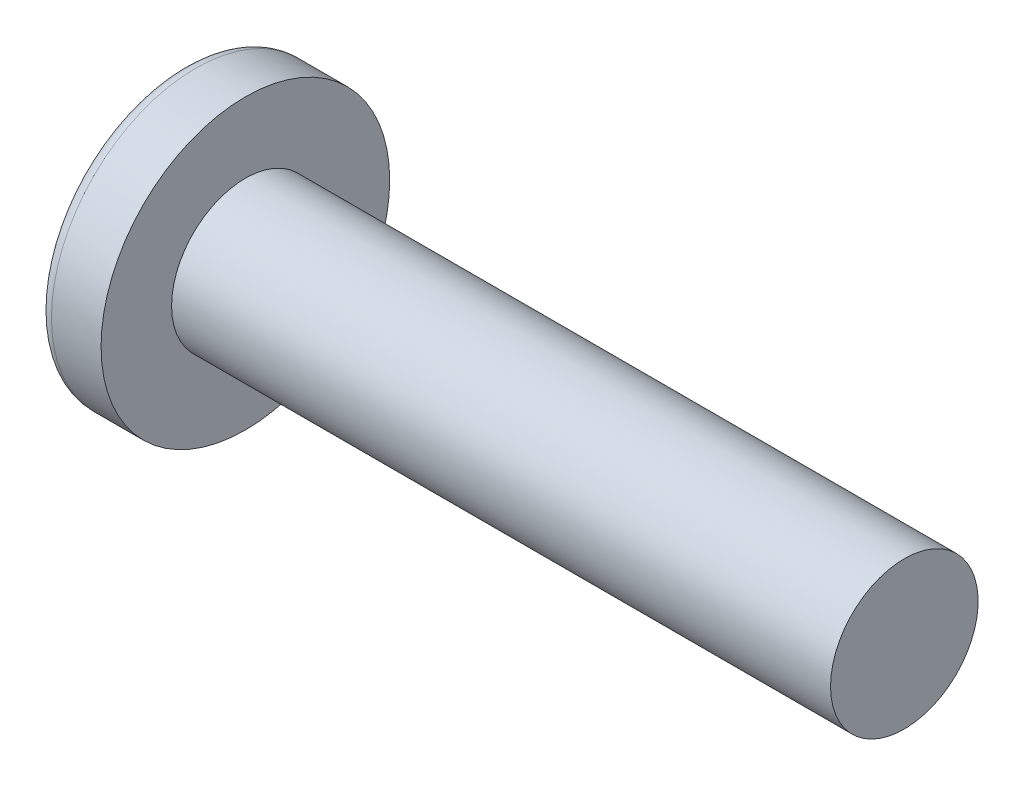
ISO-10303-21;
HEADER;
FILE_DESCRIPTION(('STEP AP214'),'2;1');
FILE_NAME('part.step','',(''),(''),'','','');
FILE_SCHEMA(('AUTOMOTIVE_DESIGN { 1 0 10303 214 1 1 1 1 }'));
ENDSEC;
DATA;
#1=APPLICATION_CONTEXT('core data for automotive mechanical design processes');
#2=APPLICATION_PROTOCOL_DEFINITION('international standard','automotive_design',2000,#1);
#3=PRODUCT_CONTEXT('',#1,'mechanical');
#4=PRODUCT('Part','Part','',(#3));
#5=PRODUCT_RELATED_PRODUCT_CATEGORY('part','',(#4));
#6=PRODUCT_DEFINITION_FORMATION('','',#4);
#7=PRODUCT_DEFINITION_CONTEXT('part definition',#1,'design');
#8=PRODUCT_DEFINITION('design','',#6,#7);
#9=PRODUCT_DEFINITION_SHAPE('','',#8);
#10=(LENGTH_UNIT() NAMED_UNIT(*) SI_UNIT(.MILLI.,.METRE.));
#11=(NAMED_UNIT(*) PLANE_ANGLE_UNIT() SI_UNIT($,.RADIAN.));
#12=(NAMED_UNIT(*) SI_UNIT($,.STERADIAN.) SOLID_ANGLE_UNIT());
#13=UNCERTAINTY_MEASURE_WITH_UNIT(LENGTH_MEASURE(1.E-05),#10,'distance_accuracy_value','');
#14=(GEOMETRIC_REPRESENTATION_CONTEXT(3) GLOBAL_UNCERTAINTY_ASSIGNED_CONTEXT((#13)) GLOBAL_UNIT_ASSIGNED_CONTEXT((#10,
#11,#12)) REPRESENTATION_CONTEXT('',''));
#15=CARTESIAN_POINT('',(0.,0.,0.));
#16=DIRECTION('',(0.,0.,1.));
#17=DIRECTION('',(1.,0.,0.));
#18=AXIS2_PLACEMENT_3D('',#15,#16,#17);
#19=CARTESIAN_POINT('',(4.55168,0.,0.));
#20=DIRECTION('',(-1.,0.,0.));
#21=DIRECTION('',(0.,1.,0.));
#22=AXIS2_PLACEMENT_3D('',#19,#20,#21);
#23=SPHERICAL_SURFACE('',#22,4.55168);
#24=CARTESIAN_POINT('',(0.870207289833468,0.,0.));
#25=DIRECTION('',(-1.,0.,0.));
#26=DIRECTION('',(0.,0.,1.));
#27=AXIS2_PLACEMENT_3D('',#24,#25,#26);
#28=CIRCLE('',#27,2.67666761229314);
#29=CARTESIAN_POINT('',(0.870207289833468,0.,2.67666761229314));
#30=VERTEX_POINT('',#29);
#31=EDGE_CURVE('E150',#30,#30,#28,.T.);
#32=ORIENTED_EDGE('',*,*,#31,.T.);
#33=EDGE_LOOP('',(#32));
#34=FACE_BOUND('',#33,.T.);
#35=CARTESIAN_POINT('',(4.54621406502776,-0.053976107850912,0.));
#36=DIRECTION('',(-0.100750553686815,-0.994911717657301,0.));
#37=DIRECTION('',(0.994911717657301,-0.100750553686815,0.));
#38=AXIS2_PLACEMENT_3D('',#35,#36,#37);
#39=CIRCLE('',#38,4.55135666870178);
#40=CARTESIAN_POINT('',(0.29828010421487,0.376194419826337,1.57634320737159));
#41=VERTEX_POINT('',#40);
#42=CARTESIAN_POINT('',(0.0357821905509186,0.402776487032817,0.402776487032818));
#43=VERTEX_POINT('',#42);
#44=EDGE_CURVE('E181',#41,#43,#39,.T.);
#45=ORIENTED_EDGE('',*,*,#44,.F.);
#46=CARTESIAN_POINT('',(3.65196023945684,0.,-1.11933639500645));
#47=DIRECTION('',(0.626498155753381,0.,0.77942290243334));
#48=DIRECTION('',(0.77942290243334,0.,-0.626498155753381));
#49=AXIS2_PLACEMENT_3D('',#46,#47,#48);
#50=CIRCLE('',#49,4.31918756361681);
#51=CARTESIAN_POINT('',(0.29828010421487,-0.376194419826348,1.57634320737159));
#52=VERTEX_POINT('',#51);
#53=EDGE_CURVE('E146',#41,#52,#50,.T.);
#54=ORIENTED_EDGE('',*,*,#53,.T.);
#55=CARTESIAN_POINT('',(4.54621406502776,0.0539761078509119,0.));
#56=DIRECTION('',(-0.100750553686815,0.9949117176573,0.));
#57=DIRECTION('',(-0.994911717657301,-0.100750553686815,0.));
#58=AXIS2_PLACEMENT_3D('',#55,#56,#57);
#59=CIRCLE('',#58,4.55135666870178);
#60=CARTESIAN_POINT('',(0.0357821905509186,-0.40277648703282,0.402776487032818));
#61=VERTEX_POINT('',#60);
#62=EDGE_CURVE('E102',#61,#52,#59,.T.);
#63=ORIENTED_EDGE('',*,*,#62,.F.);
#64=CARTESIAN_POINT('',(4.54621406502776,0.,-0.0539761078509119));
#65=DIRECTION('',(-0.100750553686815,0.,-0.9949117176573));
#66=DIRECTION('',(-0.994911717657301,0.,0.100750553686815));
#67=AXIS2_PLACEMENT_3D('',#64,#65,#66);
#68=CIRCLE('',#67,4.55135666870178);
#69=CARTESIAN_POINT('',(0.298280104214868,-1.57634320737159,0.376194419826342));
#70=VERTEX_POINT('',#69);
#71=EDGE_CURVE('E127',#70,#61,#68,.T.);
#72=ORIENTED_EDGE('',*,*,#71,.F.);
#73=CARTESIAN_POINT('',(3.65196023945684,1.11933639500645,0.));
#74=DIRECTION('',(0.626498155753381,-0.77942290243334,0.));
#75=DIRECTION('',(0.77942290243334,0.626498155753381,0.));
#76=AXIS2_PLACEMENT_3D('',#73,#74,#75);
#77=CIRCLE('',#76,4.31918756361681);
#78=CARTESIAN_POINT('',(0.298280104214869,-1.57634320737159,-0.376194419826342));
#79=VERTEX_POINT('',#78);
#80=EDGE_CURVE('E135',#70,#79,#77,.T.);
#81=ORIENTED_EDGE('',*,*,#80,.T.);
#82=CARTESIAN_POINT('',(4.54621406502776,0.,0.053976107850912));
#83=DIRECTION('',(-0.100750553686815,0.,0.994911717657301));
#84=DIRECTION('',(0.994911717657301,0.,0.100750553686815));
#85=AXIS2_PLACEMENT_3D('',#82,#83,#84);
#86=CIRCLE('',#85,4.55135666870178);
#87=CARTESIAN_POINT('',(0.0357821905509186,-0.402776487032817,-0.402776487032818));
#88=VERTEX_POINT('',#87);
#89=EDGE_CURVE('E45',#88,#79,#86,.T.);
#90=ORIENTED_EDGE('',*,*,#89,.F.);
#91=CARTESIAN_POINT('',(0.298280104214868,-0.376194419826337,-1.57634320737159));
#92=VERTEX_POINT('',#91);
#93=EDGE_CURVE('E188',#92,#88,#59,.T.);
#94=ORIENTED_EDGE('',*,*,#93,.F.);
#95=CARTESIAN_POINT('',(3.65196023945684,0.,1.11933639500645));
#96=DIRECTION('',(0.626498155753381,0.,-0.77942290243334));
#97=DIRECTION('',(-0.77942290243334,0.,-0.626498155753381));
#98=AXIS2_PLACEMENT_3D('',#95,#96,#97);
#99=CIRCLE('',#98,4.31918756361681);
#100=CARTESIAN_POINT('',(0.298280104214869,0.376194419826348,-1.57634320737159));
#101=VERTEX_POINT('',#100);
#102=EDGE_CURVE('E128',#92,#101,#99,.T.);
#103=ORIENTED_EDGE('',*,*,#102,.T.);
#104=CARTESIAN_POINT('',(0.0357821905509195,0.40277648703282,-0.402776487032818));
#105=VERTEX_POINT('',#104);
#106=EDGE_CURVE('E176',#105,#101,#39,.T.);
#107=ORIENTED_EDGE('',*,*,#106,.F.);
#108=CARTESIAN_POINT('',(0.298280104214869,1.57634320737159,-0.376194419826342));
#109=VERTEX_POINT('',#108);
#110=EDGE_CURVE('E38',#109,#105,#86,.T.);
#111=ORIENTED_EDGE('',*,*,#110,.F.);
#112=CARTESIAN_POINT('',(3.65196023945684,-1.11933639500645,0.));
#113=DIRECTION('',(0.626498155753381,0.77942290243334,0.));
#114=DIRECTION('',(-0.77942290243334,0.626498155753381,0.));
#115=AXIS2_PLACEMENT_3D('',#112,#113,#114);
#116=CIRCLE('',#115,4.31918756361681);
#117=CARTESIAN_POINT('',(0.29828010421487,1.57634320737159,0.376194419826342));
#118=VERTEX_POINT('',#117);
#119=EDGE_CURVE('E11',#109,#118,#116,.T.);
#120=ORIENTED_EDGE('',*,*,#119,.T.);
#121=EDGE_CURVE('E164',#43,#118,#68,.T.);
#122=ORIENTED_EDGE('',*,*,#121,.F.);
#123=EDGE_LOOP('',(#45,#54,#63,#72,#81,#90,#94,#103,#107,#111,#120,#122));
#124=FACE_BOUND('',#123,.T.);
#125=ADVANCED_FACE('F30',(#34,#124),#23,.T.);
#126=CARTESIAN_POINT('',(2.2594,0.,-0.1776));
#127=DIRECTION('',(-0.100750553686815,0.,0.994911717657301));
#128=DIRECTION('',(0.994911717657301,0.,0.100750553686815));
#129=AXIS2_PLACEMENT_3D('',#126,#127,#128);
#130=PLANE('',#129);
#131=ORIENTED_EDGE('',*,*,#110,.T.);
#132=DIRECTION('',(0.989900325021556,-0.100243070888259,0.100243070888259));
#133=VECTOR('',#132,1.);
#134=CARTESIAN_POINT('',(2.27702336316533,0.175815355628828,-0.175815355628827));
#135=LINE('',#134,#133);
#136=CARTESIAN_POINT('',(2.0066,0.203200000000001,-0.203199999999999));
#137=VERTEX_POINT('',#136);
#138=EDGE_CURVE('E170',#105,#137,#135,.T.);
#139=ORIENTED_EDGE('',*,*,#138,.T.);
#140=DIRECTION('',(0.777006374114706,-0.624555756408656,0.0786841897837677));
#141=VECTOR('',#140,1.);
#142=CARTESIAN_POINT('',(0.,1.8161,-0.4064));
#143=LINE('',#142,#141);
#144=EDGE_CURVE('E151',#109,#137,#143,.T.);
#145=ORIENTED_EDGE('',*,*,#144,.F.);
#146=EDGE_LOOP('',(#131,#139,#145));
#147=FACE_BOUND('',#146,.T.);
#148=ADVANCED_FACE('F169',(#147),#130,.T.);
#149=DIRECTION('',(0.777006374114706,0.624555756408656,0.0786841897837677));
#150=VECTOR('',#149,1.);
#151=CARTESIAN_POINT('',(0.,-1.8161,-0.4064));
#152=LINE('',#151,#150);
#153=CARTESIAN_POINT('',(2.0066,-0.2032,-0.2032));
#154=VERTEX_POINT('',#153);
#155=EDGE_CURVE('E136',#79,#154,#152,.T.);
#156=ORIENTED_EDGE('',*,*,#155,.T.);
#157=DIRECTION('',(-0.989900325021557,-0.100243070888258,-0.100243070888259));
#158=VECTOR('',#157,1.);
#159=CARTESIAN_POINT('',(2.27702336316533,-0.175815355628826,-0.175815355628827));
#160=LINE('',#159,#158);
#161=EDGE_CURVE('E191',#154,#88,#160,.T.);
#162=ORIENTED_EDGE('',*,*,#161,.T.);
#163=ORIENTED_EDGE('',*,*,#89,.T.);
#164=EDGE_LOOP('',(#156,#162,#163));
#165=FACE_BOUND('',#164,.T.);
#166=ADVANCED_FACE('F206',(#165),#130,.T.);
#167=CARTESIAN_POINT('',(2.2594,0.,0.1776));
#168=DIRECTION('',(-0.100750553686815,0.,-0.9949117176573));
#169=DIRECTION('',(-0.994911717657301,0.,0.100750553686815));
#170=AXIS2_PLACEMENT_3D('',#167,#168,#169);
#171=PLANE('',#170);
#172=DIRECTION('',(0.777006374114706,-0.624555756408656,-0.0786841897837678));
#173=VECTOR('',#172,1.);
#174=CARTESIAN_POINT('',(0.,1.8161,0.4064));
#175=LINE('',#174,#173);
#176=CARTESIAN_POINT('',(2.0066,0.2032,0.2032));
#177=VERTEX_POINT('',#176);
#178=EDGE_CURVE('E207',#118,#177,#175,.T.);
#179=ORIENTED_EDGE('',*,*,#178,.T.);
#180=DIRECTION('',(-0.989900325021557,0.100243070888259,0.100243070888259));
#181=VECTOR('',#180,1.);
#182=CARTESIAN_POINT('',(2.27702336316533,0.175815355628826,0.175815355628827));
#183=LINE('',#182,#181);
#184=EDGE_CURVE('E185',#177,#43,#183,.T.);
#185=ORIENTED_EDGE('',*,*,#184,.T.);
#186=ORIENTED_EDGE('',*,*,#121,.T.);
#187=EDGE_LOOP('',(#179,#185,#186));
#188=FACE_BOUND('',#187,.T.);
#189=ADVANCED_FACE('F211',(#188),#171,.T.);
#190=ORIENTED_EDGE('',*,*,#71,.T.);
#191=DIRECTION('',(0.989900325021556,0.100243070888259,-0.100243070888259));
#192=VECTOR('',#191,1.);
#193=CARTESIAN_POINT('',(2.27702336316533,-0.175815355628828,0.175815355628827));
#194=LINE('',#193,#192);
#195=CARTESIAN_POINT('',(2.0066,-0.203200000000001,0.203199999999999));
#196=VERTEX_POINT('',#195);
#197=EDGE_CURVE('E100',#61,#196,#194,.T.);
#198=ORIENTED_EDGE('',*,*,#197,.T.);
#199=DIRECTION('',(0.777006374114707,0.624555756408656,-0.0786841897837676));
#200=VECTOR('',#199,1.);
#201=CARTESIAN_POINT('',(0.,-1.8161,0.4064));
#202=LINE('',#201,#200);
#203=EDGE_CURVE('E125',#70,#196,#202,.T.);
#204=ORIENTED_EDGE('',*,*,#203,.F.);
#205=EDGE_LOOP('',(#190,#198,#204));
#206=FACE_BOUND('',#205,.T.);
#207=ADVANCED_FACE('F124',(#206),#171,.T.);
#208=CARTESIAN_POINT('',(-25.4,0.,0.));
#209=DIRECTION('',(-1.,0.,0.));
#210=DIRECTION('',(0.,0.,1.));
#211=AXIS2_PLACEMENT_3D('',#208,#209,#210);
#212=CYLINDRICAL_SURFACE('',#211,1.4224);
#213=CARTESIAN_POINT('',(14.732,0.,0.));
#214=DIRECTION('',(-1.,0.,0.));
#215=DIRECTION('',(0.,0.,1.));
#216=AXIS2_PLACEMENT_3D('',#213,#214,#215);
#217=CIRCLE('',#216,1.4224);
#218=CARTESIAN_POINT('',(14.732,0.,1.4224));
#219=VERTEX_POINT('',#218);
#220=EDGE_CURVE('E147',#219,#219,#217,.T.);
#221=ORIENTED_EDGE('',*,*,#220,.T.);
#222=EDGE_LOOP('',(#221));
#223=FACE_BOUND('',#222,.T.);
#224=CARTESIAN_POINT('',(2.032,0.,0.));
#225=DIRECTION('',(-1.,0.,0.));
#226=DIRECTION('',(0.,0.,1.));
#227=AXIS2_PLACEMENT_3D('',#224,#225,#226);
#228=CIRCLE('',#227,1.4224);
#229=CARTESIAN_POINT('',(2.032,0.,1.4224));
#230=VERTEX_POINT('',#229);
#231=EDGE_CURVE('E160',#230,#230,#228,.T.);
#232=ORIENTED_EDGE('',*,*,#231,.F.);
#233=EDGE_LOOP('',(#232));
#234=FACE_BOUND('',#233,.T.);
#235=ADVANCED_FACE('F32',(#223,#234),#212,.T.);
#236=CARTESIAN_POINT('',(2.032,1.4224,0.));
#237=DIRECTION('',(-1.,0.,0.));
#238=DIRECTION('',(0.,0.,1.));
#239=AXIS2_PLACEMENT_3D('',#236,#237,#238);
#240=PLANE('',#239);
#241=CARTESIAN_POINT('',(2.032,0.,0.));
#242=DIRECTION('',(-1.,0.,0.));
#243=DIRECTION('',(0.,0.,1.));
#244=AXIS2_PLACEMENT_3D('',#241,#242,#243);
#245=CIRCLE('',#244,2.7813);
#246=CARTESIAN_POINT('',(2.032,0.,2.7813));
#247=VERTEX_POINT('',#246);
#248=EDGE_CURVE('E157',#247,#247,#245,.T.);
#249=ORIENTED_EDGE('',*,*,#248,.F.);
#250=EDGE_LOOP('',(#249));
#251=FACE_BOUND('',#250,.T.);
#252=ORIENTED_EDGE('',*,*,#231,.T.);
#253=EDGE_LOOP('',(#252));
#254=FACE_BOUND('',#253,.T.);
#255=ADVANCED_FACE('F239',(#251,#254),#240,.F.);
#256=CARTESIAN_POINT('',(-25.4,0.,0.));
#257=DIRECTION('',(-1.,0.,0.));
#258=DIRECTION('',(0.,0.,1.));
#259=AXIS2_PLACEMENT_3D('',#256,#257,#258);
#260=CYLINDRICAL_SURFACE('',#259,2.7813);
#261=ORIENTED_EDGE('',*,*,#248,.T.);
#262=EDGE_LOOP('',(#261));
#263=FACE_BOUND('',#262,.T.);
#264=CARTESIAN_POINT('',(1.07564661517758,0.,0.));
#265=DIRECTION('',(-1.,0.,0.));
#266=DIRECTION('',(0.,0.,1.));
#267=AXIS2_PLACEMENT_3D('',#264,#265,#266);
#268=CIRCLE('',#267,2.7813);
#269=CARTESIAN_POINT('',(1.07564661517758,0.,2.7813));
#270=VERTEX_POINT('',#269);
#271=EDGE_CURVE('E154',#270,#270,#268,.T.);
#272=ORIENTED_EDGE('',*,*,#271,.F.);
#273=EDGE_LOOP('',(#272));
#274=FACE_BOUND('',#273,.T.);
#275=ADVANCED_FACE('F236',(#263,#274),#260,.T.);
#276=CARTESIAN_POINT('',(1.07564661517758,0.,0.));
#277=DIRECTION('',(-1.,0.,0.));
#278=DIRECTION('',(0.,0.,1.));
#279=AXIS2_PLACEMENT_3D('',#276,#277,#278);
#280=TOROIDAL_SURFACE('',#279,2.5273,0.254);
#281=ORIENTED_EDGE('',*,*,#271,.T.);
#282=EDGE_LOOP('',(#281));
#283=FACE_BOUND('',#282,.T.);
#284=ORIENTED_EDGE('',*,*,#31,.F.);
#285=EDGE_LOOP('',(#284));
#286=FACE_BOUND('',#285,.T.);
#287=ADVANCED_FACE('F233',(#283,#286),#280,.T.);
#288=CARTESIAN_POINT('',(14.732,1.4224,0.));
#289=DIRECTION('',(1.,0.,0.));
#290=DIRECTION('',(0.,0.,-1.));
#291=AXIS2_PLACEMENT_3D('',#288,#289,#290);
#292=PLANE('',#291);
#293=ORIENTED_EDGE('',*,*,#220,.F.);
#294=EDGE_LOOP('',(#293));
#295=FACE_BOUND('',#294,.T.);
#296=ADVANCED_FACE('F231',(#295),#292,.T.);
#297=CARTESIAN_POINT('',(0.,1.8161,0.4064));
#298=DIRECTION('',(0.626498155753381,0.77942290243334,0.));
#299=DIRECTION('',(-0.77942290243334,0.626498155753381,0.));
#300=AXIS2_PLACEMENT_3D('',#297,#298,#299);
#301=PLANE('',#300);
#302=ORIENTED_EDGE('',*,*,#144,.T.);
#303=DIRECTION('',(0.,0.,-1.));
#304=VECTOR('',#303,1.);
#305=CARTESIAN_POINT('',(2.0066,0.2032,0.2032));
#306=LINE('',#305,#304);
#307=EDGE_CURVE('E118',#177,#137,#306,.T.);
#308=ORIENTED_EDGE('',*,*,#307,.F.);
#309=ORIENTED_EDGE('',*,*,#178,.F.);
#310=ORIENTED_EDGE('',*,*,#119,.F.);
#311=EDGE_LOOP('',(#302,#308,#309,#310));
#312=FACE_BOUND('',#311,.T.);
#313=ADVANCED_FACE('F210',(#312),#301,.F.);
#314=CARTESIAN_POINT('',(2.0066,-0.2032,-0.2032));
#315=DIRECTION('',(0.626498155753381,-0.77942290243334,0.));
#316=DIRECTION('',(0.77942290243334,0.626498155753381,0.));
#317=AXIS2_PLACEMENT_3D('',#314,#315,#316);
#318=PLANE('',#317);
#319=ORIENTED_EDGE('',*,*,#203,.T.);
#320=DIRECTION('',(0.,0.,1.));
#321=VECTOR('',#320,1.);
#322=CARTESIAN_POINT('',(2.0066,-0.2032,-0.2032));
#323=LINE('',#322,#321);
#324=EDGE_CURVE('E117',#154,#196,#323,.T.);
#325=ORIENTED_EDGE('',*,*,#324,.F.);
#326=ORIENTED_EDGE('',*,*,#155,.F.);
#327=ORIENTED_EDGE('',*,*,#80,.F.);
#328=EDGE_LOOP('',(#319,#325,#326,#327));
#329=FACE_BOUND('',#328,.T.);
#330=ADVANCED_FACE('F132',(#329),#318,.F.);
#331=CARTESIAN_POINT('',(2.0066,0.2032,-0.2032));
#332=DIRECTION('',(-1.,0.,0.));
#333=DIRECTION('',(0.,0.,1.));
#334=AXIS2_PLACEMENT_3D('',#331,#332,#333);
#335=PLANE('',#334);
#336=DIRECTION('',(0.,1.,0.));
#337=VECTOR('',#336,1.);
#338=CARTESIAN_POINT('',(2.0066,-0.2032,-0.2032));
#339=LINE('',#338,#337);
#340=EDGE_CURVE('E140',#154,#137,#339,.T.);
#341=ORIENTED_EDGE('',*,*,#340,.F.);
#342=ORIENTED_EDGE('',*,*,#324,.T.);
#343=DIRECTION('',(0.,-1.,0.));
#344=VECTOR('',#343,1.);
#345=CARTESIAN_POINT('',(2.0066,0.2032,0.2032));
#346=LINE('',#345,#344);
#347=EDGE_CURVE('E109',#177,#196,#346,.T.);
#348=ORIENTED_EDGE('',*,*,#347,.F.);
#349=ORIENTED_EDGE('',*,*,#307,.T.);
#350=EDGE_LOOP('',(#341,#342,#348,#349));
#351=FACE_BOUND('',#350,.T.);
#352=ADVANCED_FACE('F138',(#351),#335,.T.);
#353=CARTESIAN_POINT('',(2.0066,0.203200000000001,-0.203199999999999));
#354=DIRECTION('',(0.626498155753381,0.,-0.77942290243334));
#355=DIRECTION('',(0.77942290243334,0.,0.626498155753381));
#356=AXIS2_PLACEMENT_3D('',#353,#354,#355);
#357=PLANE('',#356);
#358=DIRECTION('',(0.777006374114707,0.0786841897837655,0.624555756408657));
#359=VECTOR('',#358,1.);
#360=CARTESIAN_POINT('',(0.,-0.406399999999993,-1.8161));
#361=LINE('',#360,#359);
#362=EDGE_CURVE('E196',#92,#154,#361,.T.);
#363=ORIENTED_EDGE('',*,*,#362,.T.);
#364=ORIENTED_EDGE('',*,*,#340,.T.);
#365=DIRECTION('',(0.777006374114706,-0.0786841897837699,0.624555756408656));
#366=VECTOR('',#365,1.);
#367=CARTESIAN_POINT('',(0.,0.406400000000006,-1.8161));
#368=LINE('',#367,#366);
#369=EDGE_CURVE('E106',#101,#137,#368,.T.);
#370=ORIENTED_EDGE('',*,*,#369,.F.);
#371=ORIENTED_EDGE('',*,*,#102,.F.);
#372=EDGE_LOOP('',(#363,#364,#370,#371));
#373=FACE_BOUND('',#372,.T.);
#374=ADVANCED_FACE('F201',(#373),#357,.F.);
#375=CARTESIAN_POINT('',(2.2594,-0.1776,0.));
#376=DIRECTION('',(-0.100750553686815,0.9949117176573,0.));
#377=DIRECTION('',(-0.994911717657301,-0.100750553686815,0.));
#378=AXIS2_PLACEMENT_3D('',#375,#376,#377);
#379=PLANE('',#378);
#380=ORIENTED_EDGE('',*,*,#93,.T.);
#381=ORIENTED_EDGE('',*,*,#161,.F.);
#382=ORIENTED_EDGE('',*,*,#362,.F.);
#383=EDGE_LOOP('',(#380,#381,#382));
#384=FACE_BOUND('',#383,.T.);
#385=ADVANCED_FACE('F205',(#384),#379,.T.);
#386=CARTESIAN_POINT('',(2.2594,0.1776,0.));
#387=DIRECTION('',(-0.100750553686815,-0.994911717657301,0.));
#388=DIRECTION('',(0.994911717657301,-0.100750553686815,0.));
#389=AXIS2_PLACEMENT_3D('',#386,#387,#388);
#390=PLANE('',#389);
#391=ORIENTED_EDGE('',*,*,#106,.T.);
#392=ORIENTED_EDGE('',*,*,#369,.T.);
#393=ORIENTED_EDGE('',*,*,#138,.F.);
#394=EDGE_LOOP('',(#391,#392,#393));
#395=FACE_BOUND('',#394,.T.);
#396=ADVANCED_FACE('F199',(#395),#390,.T.);
#397=CARTESIAN_POINT('',(0.,-0.406400000000006,1.8161));
#398=DIRECTION('',(0.626498155753381,0.,0.77942290243334));
#399=DIRECTION('',(-0.77942290243334,0.,0.626498155753381));
#400=AXIS2_PLACEMENT_3D('',#397,#398,#399);
#401=PLANE('',#400);
#402=DIRECTION('',(0.777006374114706,-0.0786841897837656,-0.624555756408657));
#403=VECTOR('',#402,1.);
#404=CARTESIAN_POINT('',(0.,0.406399999999994,1.8161));
#405=LINE('',#404,#403);
#406=EDGE_CURVE('E105',#41,#177,#405,.T.);
#407=ORIENTED_EDGE('',*,*,#406,.T.);
#408=ORIENTED_EDGE('',*,*,#347,.T.);
#409=DIRECTION('',(0.777006374114706,0.07868418978377,-0.624555756408656));
#410=VECTOR('',#409,1.);
#411=CARTESIAN_POINT('',(0.,-0.406400000000006,1.8161));
#412=LINE('',#411,#410);
#413=EDGE_CURVE('E96',#52,#196,#412,.T.);
#414=ORIENTED_EDGE('',*,*,#413,.F.);
#415=ORIENTED_EDGE('',*,*,#53,.F.);
#416=EDGE_LOOP('',(#407,#408,#414,#415));
#417=FACE_BOUND('',#416,.T.);
#418=ADVANCED_FACE('F110',(#417),#401,.F.);
#419=ORIENTED_EDGE('',*,*,#44,.T.);
#420=ORIENTED_EDGE('',*,*,#184,.F.);
#421=ORIENTED_EDGE('',*,*,#406,.F.);
#422=EDGE_LOOP('',(#419,#420,#421));
#423=FACE_BOUND('',#422,.T.);
#424=ADVANCED_FACE('F212',(#423),#390,.T.);
#425=ORIENTED_EDGE('',*,*,#62,.T.);
#426=ORIENTED_EDGE('',*,*,#413,.T.);
#427=ORIENTED_EDGE('',*,*,#197,.F.);
#428=EDGE_LOOP('',(#425,#426,#427));
#429=FACE_BOUND('',#428,.T.);
#430=ADVANCED_FACE('F98',(#429),#379,.T.);
#431=CLOSED_SHELL('',(#125,#148,#166,#189,#207,#235,#255,#275,#287,#296,#313,#330,#352,#374,
#385,#396,#418,#424,#430));
#432=MANIFOLD_SOLID_BREP('B2',#431);
#433=ADVANCED_BREP_SHAPE_REPRESENTATION('',(#18,#432),#14);
#434=SHAPE_DEFINITION_REPRESENTATION(#9,#433);
ENDSEC;
END-ISO-10303-21;
